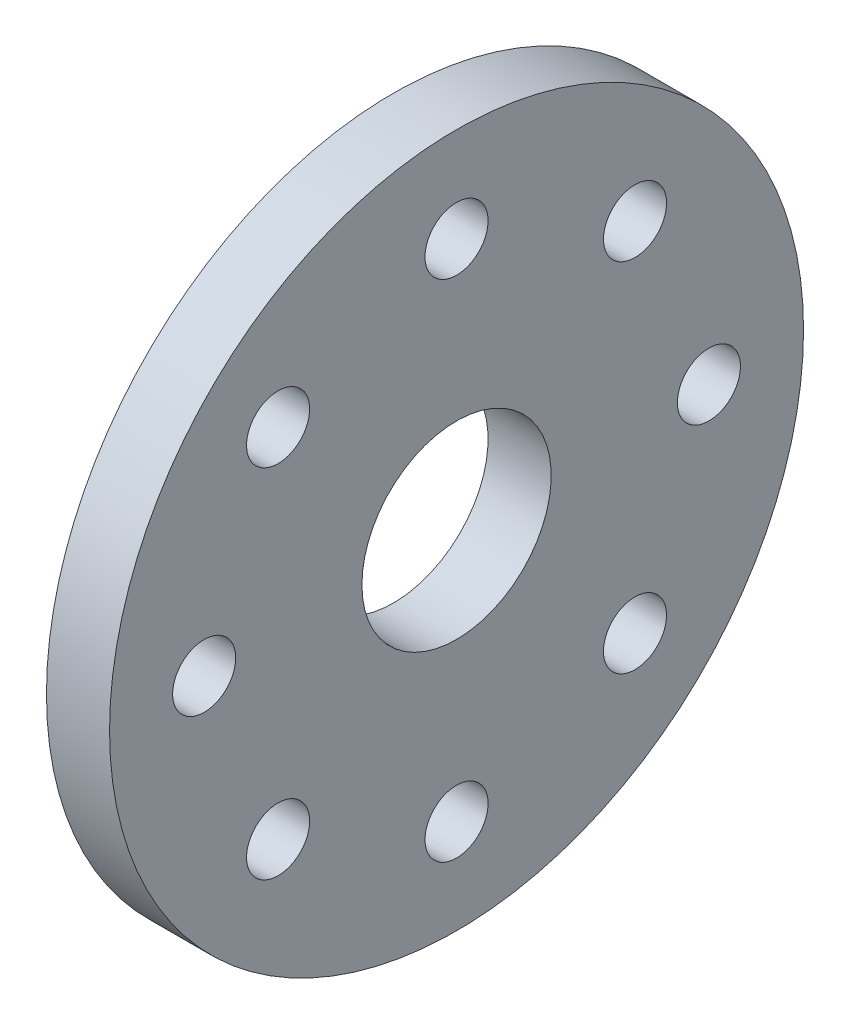
ISO-10303-21;
HEADER;
FILE_DESCRIPTION(('STEP AP214'),'2;1');
FILE_NAME('part.step','',(''),(''),'','','');
FILE_SCHEMA(('AUTOMOTIVE_DESIGN { 1 0 10303 214 1 1 1 1 }'));
ENDSEC;
DATA;
#1=APPLICATION_CONTEXT('core data for automotive mechanical design processes');
#2=APPLICATION_PROTOCOL_DEFINITION('international standard','automotive_design',2000,#1);
#3=PRODUCT_CONTEXT('',#1,'mechanical');
#4=PRODUCT('Part','Part','',(#3));
#5=PRODUCT_RELATED_PRODUCT_CATEGORY('part','',(#4));
#6=PRODUCT_DEFINITION_FORMATION('','',#4);
#7=PRODUCT_DEFINITION_CONTEXT('part definition',#1,'design');
#8=PRODUCT_DEFINITION('design','',#6,#7);
#9=PRODUCT_DEFINITION_SHAPE('','',#8);
#10=(LENGTH_UNIT() NAMED_UNIT(*) SI_UNIT(.MILLI.,.METRE.));
#11=(NAMED_UNIT(*) PLANE_ANGLE_UNIT() SI_UNIT($,.RADIAN.));
#12=(NAMED_UNIT(*) SI_UNIT($,.STERADIAN.) SOLID_ANGLE_UNIT());
#13=UNCERTAINTY_MEASURE_WITH_UNIT(LENGTH_MEASURE(1.E-05),#10,'distance_accuracy_value','');
#14=(GEOMETRIC_REPRESENTATION_CONTEXT(3) GLOBAL_UNCERTAINTY_ASSIGNED_CONTEXT((#13)) GLOBAL_UNIT_ASSIGNED_CONTEXT((#10,
#11,#12)) REPRESENTATION_CONTEXT('',''));
#15=CARTESIAN_POINT('',(0.,0.,0.));
#16=DIRECTION('',(0.,0.,1.));
#17=DIRECTION('',(1.,0.,0.));
#18=AXIS2_PLACEMENT_3D('',#15,#16,#17);
#19=CARTESIAN_POINT('',(0.,0.,0.));
#20=DIRECTION('',(-1.,0.,0.));
#21=DIRECTION('',(0.,0.,1.));
#22=AXIS2_PLACEMENT_3D('',#19,#20,#21);
#23=CYLINDRICAL_SURFACE('',#22,3.);
#24=CARTESIAN_POINT('',(1.,0.,0.));
#25=DIRECTION('',(-1.,0.,0.));
#26=DIRECTION('',(0.,0.,1.));
#27=AXIS2_PLACEMENT_3D('',#24,#25,#26);
#28=CIRCLE('',#27,3.);
#29=CARTESIAN_POINT('',(1.,0.,3.));
#30=VERTEX_POINT('',#29);
#31=EDGE_CURVE('E29',#30,#30,#28,.T.);
#32=ORIENTED_EDGE('',*,*,#31,.F.);
#33=EDGE_LOOP('',(#32));
#34=FACE_BOUND('',#33,.T.);
#35=CARTESIAN_POINT('',(-1.,0.,0.));
#36=DIRECTION('',(-1.,0.,0.));
#37=DIRECTION('',(0.,0.,1.));
#38=AXIS2_PLACEMENT_3D('',#35,#36,#37);
#39=CIRCLE('',#38,3.);
#40=CARTESIAN_POINT('',(-1.,0.,3.));
#41=VERTEX_POINT('',#40);
#42=EDGE_CURVE('E10',#41,#41,#39,.T.);
#43=ORIENTED_EDGE('',*,*,#42,.T.);
#44=EDGE_LOOP('',(#43));
#45=FACE_BOUND('',#44,.T.);
#46=ADVANCED_FACE('F15',(#34,#45),#23,.F.);
#47=CARTESIAN_POINT('',(-1.,3.,0.));
#48=DIRECTION('',(1.,0.,0.));
#49=DIRECTION('',(0.,0.,-1.));
#50=AXIS2_PLACEMENT_3D('',#47,#48,#49);
#51=PLANE('',#50);
#52=CARTESIAN_POINT('',(-1.,5.65685424949245,5.65685424949231));
#53=DIRECTION('',(-1.,0.,0.));
#54=DIRECTION('',(0.,-0.707106781186539,0.707106781186556));
#55=AXIS2_PLACEMENT_3D('',#52,#53,#54);
#56=CIRCLE('',#55,1.);
#57=CARTESIAN_POINT('',(-1.,4.94974746830591,6.36396103067887));
#58=VERTEX_POINT('',#57);
#59=EDGE_CURVE('E77',#58,#58,#56,.T.);
#60=ORIENTED_EDGE('',*,*,#59,.F.);
#61=EDGE_LOOP('',(#60));
#62=FACE_BOUND('',#61,.T.);
#63=CARTESIAN_POINT('',(-1.,0.,8.));
#64=DIRECTION('',(-1.,0.,0.));
#65=DIRECTION('',(0.,-1.,0.));
#66=AXIS2_PLACEMENT_3D('',#63,#64,#65);
#67=CIRCLE('',#66,1.);
#68=CARTESIAN_POINT('',(-1.,-0.999999999999916,8.00000000000001));
#69=VERTEX_POINT('',#68);
#70=EDGE_CURVE('E71',#69,#69,#67,.T.);
#71=ORIENTED_EDGE('',*,*,#70,.F.);
#72=EDGE_LOOP('',(#71));
#73=FACE_BOUND('',#72,.T.);
#74=CARTESIAN_POINT('',(-1.,-5.65685424949233,5.65685424949243));
#75=DIRECTION('',(-1.,0.,0.));
#76=DIRECTION('',(0.,-0.707106781186554,-0.707106781186541));
#77=AXIS2_PLACEMENT_3D('',#74,#75,#76);
#78=CIRCLE('',#77,1.);
#79=CARTESIAN_POINT('',(-1.,-6.36396103067888,4.94974746830589));
#80=VERTEX_POINT('',#79);
#81=EDGE_CURVE('E65',#80,#80,#78,.T.);
#82=ORIENTED_EDGE('',*,*,#81,.F.);
#83=EDGE_LOOP('',(#82));
#84=FACE_BOUND('',#83,.T.);
#85=CARTESIAN_POINT('',(-1.,-8.,0.));
#86=DIRECTION('',(-1.,0.,0.));
#87=DIRECTION('',(0.,0.,-1.));
#88=AXIS2_PLACEMENT_3D('',#85,#86,#87);
#89=CIRCLE('',#88,1.);
#90=CARTESIAN_POINT('',(-1.,-8.,-1.));
#91=VERTEX_POINT('',#90);
#92=EDGE_CURVE('E59',#91,#91,#89,.T.);
#93=ORIENTED_EDGE('',*,*,#92,.F.);
#94=EDGE_LOOP('',(#93));
#95=FACE_BOUND('',#94,.T.);
#96=CARTESIAN_POINT('',(-1.,-5.65685424949241,-5.65685424949235));
#97=DIRECTION('',(-1.,0.,0.));
#98=DIRECTION('',(0.,0.707106781186544,-0.707106781186551));
#99=AXIS2_PLACEMENT_3D('',#96,#97,#98);
#100=CIRCLE('',#99,1.);
#101=CARTESIAN_POINT('',(-1.,-4.94974746830587,-6.3639610306789));
#102=VERTEX_POINT('',#101);
#103=EDGE_CURVE('E53',#102,#102,#100,.T.);
#104=ORIENTED_EDGE('',*,*,#103,.F.);
#105=EDGE_LOOP('',(#104));
#106=FACE_BOUND('',#105,.T.);
#107=CARTESIAN_POINT('',(-1.,0.,-8.));
#108=DIRECTION('',(-1.,0.,0.));
#109=DIRECTION('',(0.,1.,0.));
#110=AXIS2_PLACEMENT_3D('',#107,#108,#109);
#111=CIRCLE('',#110,1.);
#112=CARTESIAN_POINT('',(-1.,0.999999999999972,-8.));
#113=VERTEX_POINT('',#112);
#114=EDGE_CURVE('E47',#113,#113,#111,.T.);
#115=ORIENTED_EDGE('',*,*,#114,.F.);
#116=EDGE_LOOP('',(#115));
#117=FACE_BOUND('',#116,.T.);
#118=CARTESIAN_POINT('',(-1.,5.65685424949237,-5.65685424949239));
#119=DIRECTION('',(-1.,0.,0.));
#120=DIRECTION('',(0.,0.707106781186549,0.707106781186546));
#121=AXIS2_PLACEMENT_3D('',#118,#119,#120);
#122=CIRCLE('',#121,1.);
#123=CARTESIAN_POINT('',(-1.,6.36396103067892,-4.94974746830584));
#124=VERTEX_POINT('',#123);
#125=EDGE_CURVE('E41',#124,#124,#122,.T.);
#126=ORIENTED_EDGE('',*,*,#125,.F.);
#127=EDGE_LOOP('',(#126));
#128=FACE_BOUND('',#127,.T.);
#129=CARTESIAN_POINT('',(-1.,8.,0.));
#130=DIRECTION('',(-1.,0.,0.));
#131=DIRECTION('',(0.,0.,1.));
#132=AXIS2_PLACEMENT_3D('',#129,#130,#131);
#133=CIRCLE('',#132,1.);
#134=CARTESIAN_POINT('',(-1.,8.,1.));
#135=VERTEX_POINT('',#134);
#136=EDGE_CURVE('E35',#135,#135,#133,.T.);
#137=ORIENTED_EDGE('',*,*,#136,.F.);
#138=EDGE_LOOP('',(#137));
#139=FACE_BOUND('',#138,.T.);
#140=ORIENTED_EDGE('',*,*,#42,.F.);
#141=EDGE_LOOP('',(#140));
#142=FACE_BOUND('',#141,.T.);
#143=CARTESIAN_POINT('',(-1.,0.,0.));
#144=DIRECTION('',(-1.,0.,0.));
#145=DIRECTION('',(0.,0.,1.));
#146=AXIS2_PLACEMENT_3D('',#143,#144,#145);
#147=CIRCLE('',#146,11.);
#148=CARTESIAN_POINT('',(-1.,0.,11.));
#149=VERTEX_POINT('',#148);
#150=EDGE_CURVE('E21',#149,#149,#147,.T.);
#151=ORIENTED_EDGE('',*,*,#150,.T.);
#152=EDGE_LOOP('',(#151));
#153=FACE_BOUND('',#152,.T.);
#154=ADVANCED_FACE('F93',(#62,#73,#84,#95,#106,#117,#128,#139,#142,#153),#51,.F.);
#155=CARTESIAN_POINT('',(0.,0.,0.));
#156=DIRECTION('',(-1.,0.,0.));
#157=DIRECTION('',(0.,0.,1.));
#158=AXIS2_PLACEMENT_3D('',#155,#156,#157);
#159=CYLINDRICAL_SURFACE('',#158,11.);
#160=ORIENTED_EDGE('',*,*,#150,.F.);
#161=EDGE_LOOP('',(#160));
#162=FACE_BOUND('',#161,.T.);
#163=CARTESIAN_POINT('',(1.,0.,0.));
#164=DIRECTION('',(-1.,0.,0.));
#165=DIRECTION('',(0.,0.,1.));
#166=AXIS2_PLACEMENT_3D('',#163,#164,#165);
#167=CIRCLE('',#166,11.);
#168=CARTESIAN_POINT('',(1.,0.,11.));
#169=VERTEX_POINT('',#168);
#170=EDGE_CURVE('E25',#169,#169,#167,.T.);
#171=ORIENTED_EDGE('',*,*,#170,.T.);
#172=EDGE_LOOP('',(#171));
#173=FACE_BOUND('',#172,.T.);
#174=ADVANCED_FACE('F96',(#162,#173),#159,.T.);
#175=CARTESIAN_POINT('',(1.,11.,0.));
#176=DIRECTION('',(-1.,0.,0.));
#177=DIRECTION('',(0.,0.,1.));
#178=AXIS2_PLACEMENT_3D('',#175,#176,#177);
#179=PLANE('',#178);
#180=CARTESIAN_POINT('',(1.,5.65685424949245,5.65685424949231));
#181=DIRECTION('',(-1.,0.,0.));
#182=DIRECTION('',(0.,-0.707106781186539,0.707106781186556));
#183=AXIS2_PLACEMENT_3D('',#180,#181,#182);
#184=CIRCLE('',#183,1.);
#185=CARTESIAN_POINT('',(1.,4.94974746830591,6.36396103067887));
#186=VERTEX_POINT('',#185);
#187=EDGE_CURVE('E74',#186,#186,#184,.T.);
#188=ORIENTED_EDGE('',*,*,#187,.T.);
#189=EDGE_LOOP('',(#188));
#190=FACE_BOUND('',#189,.T.);
#191=CARTESIAN_POINT('',(1.,0.,8.));
#192=DIRECTION('',(-1.,0.,0.));
#193=DIRECTION('',(0.,-1.,0.));
#194=AXIS2_PLACEMENT_3D('',#191,#192,#193);
#195=CIRCLE('',#194,1.);
#196=CARTESIAN_POINT('',(1.,-0.999999999999916,8.00000000000001));
#197=VERTEX_POINT('',#196);
#198=EDGE_CURVE('E68',#197,#197,#195,.T.);
#199=ORIENTED_EDGE('',*,*,#198,.T.);
#200=EDGE_LOOP('',(#199));
#201=FACE_BOUND('',#200,.T.);
#202=CARTESIAN_POINT('',(1.,-5.65685424949233,5.65685424949243));
#203=DIRECTION('',(-1.,0.,0.));
#204=DIRECTION('',(0.,-0.707106781186554,-0.707106781186541));
#205=AXIS2_PLACEMENT_3D('',#202,#203,#204);
#206=CIRCLE('',#205,1.);
#207=CARTESIAN_POINT('',(1.,-6.36396103067888,4.94974746830589));
#208=VERTEX_POINT('',#207);
#209=EDGE_CURVE('E62',#208,#208,#206,.T.);
#210=ORIENTED_EDGE('',*,*,#209,.T.);
#211=EDGE_LOOP('',(#210));
#212=FACE_BOUND('',#211,.T.);
#213=CARTESIAN_POINT('',(1.,-8.,0.));
#214=DIRECTION('',(-1.,0.,0.));
#215=DIRECTION('',(0.,0.,-1.));
#216=AXIS2_PLACEMENT_3D('',#213,#214,#215);
#217=CIRCLE('',#216,1.);
#218=CARTESIAN_POINT('',(1.,-8.,-1.));
#219=VERTEX_POINT('',#218);
#220=EDGE_CURVE('E56',#219,#219,#217,.T.);
#221=ORIENTED_EDGE('',*,*,#220,.T.);
#222=EDGE_LOOP('',(#221));
#223=FACE_BOUND('',#222,.T.);
#224=CARTESIAN_POINT('',(1.,-5.65685424949241,-5.65685424949235));
#225=DIRECTION('',(-1.,0.,0.));
#226=DIRECTION('',(0.,0.707106781186544,-0.707106781186551));
#227=AXIS2_PLACEMENT_3D('',#224,#225,#226);
#228=CIRCLE('',#227,1.);
#229=CARTESIAN_POINT('',(1.,-4.94974746830587,-6.3639610306789));
#230=VERTEX_POINT('',#229);
#231=EDGE_CURVE('E50',#230,#230,#228,.T.);
#232=ORIENTED_EDGE('',*,*,#231,.T.);
#233=EDGE_LOOP('',(#232));
#234=FACE_BOUND('',#233,.T.);
#235=CARTESIAN_POINT('',(1.,0.,-8.));
#236=DIRECTION('',(-1.,0.,0.));
#237=DIRECTION('',(0.,1.,0.));
#238=AXIS2_PLACEMENT_3D('',#235,#236,#237);
#239=CIRCLE('',#238,1.);
#240=CARTESIAN_POINT('',(1.,0.999999999999972,-8.));
#241=VERTEX_POINT('',#240);
#242=EDGE_CURVE('E44',#241,#241,#239,.T.);
#243=ORIENTED_EDGE('',*,*,#242,.T.);
#244=EDGE_LOOP('',(#243));
#245=FACE_BOUND('',#244,.T.);
#246=CARTESIAN_POINT('',(1.,5.65685424949237,-5.65685424949239));
#247=DIRECTION('',(-1.,0.,0.));
#248=DIRECTION('',(0.,0.707106781186549,0.707106781186546));
#249=AXIS2_PLACEMENT_3D('',#246,#247,#248);
#250=CIRCLE('',#249,1.);
#251=CARTESIAN_POINT('',(1.,6.36396103067892,-4.94974746830584));
#252=VERTEX_POINT('',#251);
#253=EDGE_CURVE('E38',#252,#252,#250,.T.);
#254=ORIENTED_EDGE('',*,*,#253,.T.);
#255=EDGE_LOOP('',(#254));
#256=FACE_BOUND('',#255,.T.);
#257=CARTESIAN_POINT('',(1.,8.,0.));
#258=DIRECTION('',(-1.,0.,0.));
#259=DIRECTION('',(0.,0.,1.));
#260=AXIS2_PLACEMENT_3D('',#257,#258,#259);
#261=CIRCLE('',#260,1.);
#262=CARTESIAN_POINT('',(1.,8.,1.));
#263=VERTEX_POINT('',#262);
#264=EDGE_CURVE('E34',#263,#263,#261,.T.);
#265=ORIENTED_EDGE('',*,*,#264,.T.);
#266=EDGE_LOOP('',(#265));
#267=FACE_BOUND('',#266,.T.);
#268=ORIENTED_EDGE('',*,*,#170,.F.);
#269=EDGE_LOOP('',(#268));
#270=FACE_BOUND('',#269,.T.);
#271=ORIENTED_EDGE('',*,*,#31,.T.);
#272=EDGE_LOOP('',(#271));
#273=FACE_BOUND('',#272,.T.);
#274=ADVANCED_FACE('F83',(#190,#201,#212,#223,#234,#245,#256,#267,#270,#273),#179,.F.);
#275=CARTESIAN_POINT('',(1.,8.,0.));
#276=DIRECTION('',(-1.,0.,0.));
#277=DIRECTION('',(0.,0.,1.));
#278=AXIS2_PLACEMENT_3D('',#275,#276,#277);
#279=CYLINDRICAL_SURFACE('',#278,1.);
#280=ORIENTED_EDGE('',*,*,#264,.F.);
#281=EDGE_LOOP('',(#280));
#282=FACE_BOUND('',#281,.T.);
#283=ORIENTED_EDGE('',*,*,#136,.T.);
#284=EDGE_LOOP('',(#283));
#285=FACE_BOUND('',#284,.T.);
#286=ADVANCED_FACE('F112',(#282,#285),#279,.F.);
#287=CARTESIAN_POINT('',(1.,5.65685424949237,-5.65685424949239));
#288=DIRECTION('',(-1.,0.,0.));
#289=DIRECTION('',(0.,0.,1.));
#290=AXIS2_PLACEMENT_3D('',#287,#288,#289);
#291=CYLINDRICAL_SURFACE('',#290,1.);
#292=ORIENTED_EDGE('',*,*,#253,.F.);
#293=EDGE_LOOP('',(#292));
#294=FACE_BOUND('',#293,.T.);
#295=ORIENTED_EDGE('',*,*,#125,.T.);
#296=EDGE_LOOP('',(#295));
#297=FACE_BOUND('',#296,.T.);
#298=ADVANCED_FACE('F114',(#294,#297),#291,.F.);
#299=CARTESIAN_POINT('',(1.,0.,-8.));
#300=DIRECTION('',(-1.,0.,0.));
#301=DIRECTION('',(0.,0.,1.));
#302=AXIS2_PLACEMENT_3D('',#299,#300,#301);
#303=CYLINDRICAL_SURFACE('',#302,1.);
#304=ORIENTED_EDGE('',*,*,#242,.F.);
#305=EDGE_LOOP('',(#304));
#306=FACE_BOUND('',#305,.T.);
#307=ORIENTED_EDGE('',*,*,#114,.T.);
#308=EDGE_LOOP('',(#307));
#309=FACE_BOUND('',#308,.T.);
#310=ADVANCED_FACE('F122',(#306,#309),#303,.F.);
#311=CARTESIAN_POINT('',(1.,-5.65685424949241,-5.65685424949235));
#312=DIRECTION('',(-1.,0.,0.));
#313=DIRECTION('',(0.,0.,1.));
#314=AXIS2_PLACEMENT_3D('',#311,#312,#313);
#315=CYLINDRICAL_SURFACE('',#314,1.);
#316=ORIENTED_EDGE('',*,*,#231,.F.);
#317=EDGE_LOOP('',(#316));
#318=FACE_BOUND('',#317,.T.);
#319=ORIENTED_EDGE('',*,*,#103,.T.);
#320=EDGE_LOOP('',(#319));
#321=FACE_BOUND('',#320,.T.);
#322=ADVANCED_FACE('F180',(#318,#321),#315,.F.);
#323=CARTESIAN_POINT('',(1.,-8.,0.));
#324=DIRECTION('',(-1.,0.,0.));
#325=DIRECTION('',(0.,0.,1.));
#326=AXIS2_PLACEMENT_3D('',#323,#324,#325);
#327=CYLINDRICAL_SURFACE('',#326,1.);
#328=ORIENTED_EDGE('',*,*,#220,.F.);
#329=EDGE_LOOP('',(#328));
#330=FACE_BOUND('',#329,.T.);
#331=ORIENTED_EDGE('',*,*,#92,.T.);
#332=EDGE_LOOP('',(#331));
#333=FACE_BOUND('',#332,.T.);
#334=ADVANCED_FACE('F191',(#330,#333),#327,.F.);
#335=CARTESIAN_POINT('',(1.,-5.65685424949233,5.65685424949243));
#336=DIRECTION('',(-1.,0.,0.));
#337=DIRECTION('',(0.,0.,1.));
#338=AXIS2_PLACEMENT_3D('',#335,#336,#337);
#339=CYLINDRICAL_SURFACE('',#338,1.);
#340=ORIENTED_EDGE('',*,*,#209,.F.);
#341=EDGE_LOOP('',(#340));
#342=FACE_BOUND('',#341,.T.);
#343=ORIENTED_EDGE('',*,*,#81,.T.);
#344=EDGE_LOOP('',(#343));
#345=FACE_BOUND('',#344,.T.);
#346=ADVANCED_FACE('F202',(#342,#345),#339,.F.);
#347=CARTESIAN_POINT('',(1.,0.,8.));
#348=DIRECTION('',(-1.,0.,0.));
#349=DIRECTION('',(0.,0.,1.));
#350=AXIS2_PLACEMENT_3D('',#347,#348,#349);
#351=CYLINDRICAL_SURFACE('',#350,1.);
#352=ORIENTED_EDGE('',*,*,#198,.F.);
#353=EDGE_LOOP('',(#352));
#354=FACE_BOUND('',#353,.T.);
#355=ORIENTED_EDGE('',*,*,#70,.T.);
#356=EDGE_LOOP('',(#355));
#357=FACE_BOUND('',#356,.T.);
#358=ADVANCED_FACE('F89',(#354,#357),#351,.F.);
#359=CARTESIAN_POINT('',(1.,5.65685424949245,5.65685424949231));
#360=DIRECTION('',(-1.,0.,0.));
#361=DIRECTION('',(0.,0.,1.));
#362=AXIS2_PLACEMENT_3D('',#359,#360,#361);
#363=CYLINDRICAL_SURFACE('',#362,1.);
#364=ORIENTED_EDGE('',*,*,#187,.F.);
#365=EDGE_LOOP('',(#364));
#366=FACE_BOUND('',#365,.T.);
#367=ORIENTED_EDGE('',*,*,#59,.T.);
#368=EDGE_LOOP('',(#367));
#369=FACE_BOUND('',#368,.T.);
#370=ADVANCED_FACE('F86',(#366,#369),#363,.F.);
#371=CLOSED_SHELL('',(#46,#154,#174,#274,#286,#298,#310,#322,#334,#346,#358,#370));
#372=MANIFOLD_SOLID_BREP('B1',#371);
#373=ADVANCED_BREP_SHAPE_REPRESENTATION('',(#18,#372),#14);
#374=SHAPE_DEFINITION_REPRESENTATION(#9,#373);
ENDSEC;
END-ISO-10303-21;
